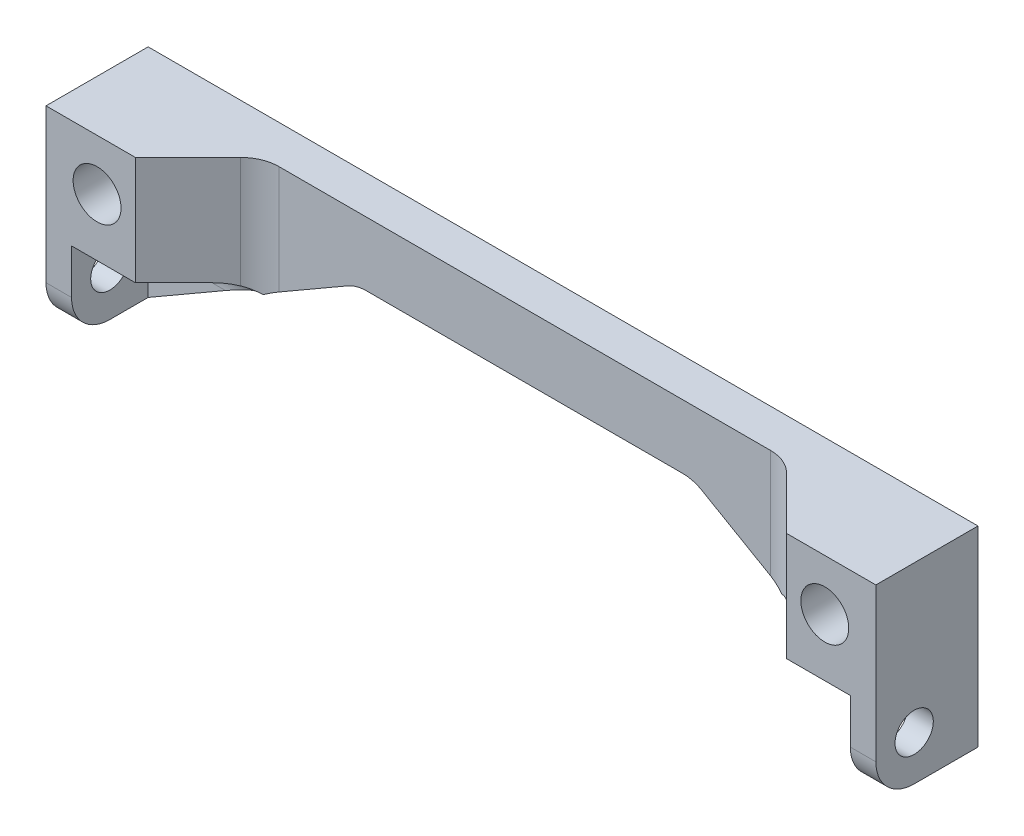
ISO-10303-21;
HEADER;
FILE_DESCRIPTION(('STEP AP214'),'2;1');
FILE_NAME('part.step','',(''),(''),'','','');
FILE_SCHEMA(('AUTOMOTIVE_DESIGN { 1 0 10303 214 1 1 1 1 }'));
ENDSEC;
DATA;
#1=APPLICATION_CONTEXT('core data for automotive mechanical design processes');
#2=APPLICATION_PROTOCOL_DEFINITION('international standard','automotive_design',2000,#1);
#3=PRODUCT_CONTEXT('',#1,'mechanical');
#4=PRODUCT('Part','Part','',(#3));
#5=PRODUCT_RELATED_PRODUCT_CATEGORY('part','',(#4));
#6=PRODUCT_DEFINITION_FORMATION('','',#4);
#7=PRODUCT_DEFINITION_CONTEXT('part definition',#1,'design');
#8=PRODUCT_DEFINITION('design','',#6,#7);
#9=PRODUCT_DEFINITION_SHAPE('','',#8);
#10=(LENGTH_UNIT() NAMED_UNIT(*) SI_UNIT(.MILLI.,.METRE.));
#11=(NAMED_UNIT(*) PLANE_ANGLE_UNIT() SI_UNIT($,.RADIAN.));
#12=(NAMED_UNIT(*) SI_UNIT($,.STERADIAN.) SOLID_ANGLE_UNIT());
#13=UNCERTAINTY_MEASURE_WITH_UNIT(LENGTH_MEASURE(1.E-05),#10,'distance_accuracy_value','');
#14=(GEOMETRIC_REPRESENTATION_CONTEXT(3) GLOBAL_UNCERTAINTY_ASSIGNED_CONTEXT((#13)) GLOBAL_UNIT_ASSIGNED_CONTEXT((#10,
#11,#12)) REPRESENTATION_CONTEXT('',''));
#15=CARTESIAN_POINT('',(0.,0.,0.));
#16=DIRECTION('',(0.,0.,1.));
#17=DIRECTION('',(1.,0.,0.));
#18=AXIS2_PLACEMENT_3D('',#15,#16,#17);
#19=CARTESIAN_POINT('',(-65.,0.,16.));
#20=DIRECTION('',(0.,0.,-1.));
#21=DIRECTION('',(-1.,0.,0.));
#22=AXIS2_PLACEMENT_3D('',#19,#20,#21);
#23=PLANE('',#22);
#24=CARTESIAN_POINT('',(-57.,-8.,16.));
#25=DIRECTION('',(0.,0.,1.));
#26=DIRECTION('',(1.,0.,0.));
#27=AXIS2_PLACEMENT_3D('',#24,#25,#26);
#28=CIRCLE('',#27,3.75);
#29=CARTESIAN_POINT('',(-53.25,-8.,16.));
#30=VERTEX_POINT('',#29);
#31=EDGE_CURVE('E290',#30,#30,#28,.T.);
#32=ORIENTED_EDGE('',*,*,#31,.F.);
#33=EDGE_LOOP('',(#32));
#34=FACE_BOUND('',#33,.T.);
#35=DIRECTION('',(0.,-1.,0.));
#36=VECTOR('',#35,1.);
#37=CARTESIAN_POINT('',(-65.,-30.,16.));
#38=LINE('',#37,#36);
#39=CARTESIAN_POINT('',(-65.,0.,16.));
#40=VERTEX_POINT('',#39);
#41=CARTESIAN_POINT('',(-65.,-24.,16.));
#42=VERTEX_POINT('',#41);
#43=EDGE_CURVE('E296',#40,#42,#38,.T.);
#44=ORIENTED_EDGE('',*,*,#43,.T.);
#45=DIRECTION('',(1.,0.,0.));
#46=VECTOR('',#45,1.);
#47=CARTESIAN_POINT('',(-65.,-24.,16.));
#48=LINE('',#47,#46);
#49=CARTESIAN_POINT('',(-61.,-24.,16.));
#50=VERTEX_POINT('',#49);
#51=EDGE_CURVE('E388',#42,#50,#48,.T.);
#52=ORIENTED_EDGE('',*,*,#51,.T.);
#53=DIRECTION('',(0.,1.,0.));
#54=VECTOR('',#53,1.);
#55=CARTESIAN_POINT('',(-61.,-30.,16.));
#56=LINE('',#55,#54);
#57=CARTESIAN_POINT('',(-61.,-17.,16.));
#58=VERTEX_POINT('',#57);
#59=EDGE_CURVE('E241',#50,#58,#56,.T.);
#60=ORIENTED_EDGE('',*,*,#59,.T.);
#61=DIRECTION('',(-1.,0.,0.));
#62=VECTOR('',#61,1.);
#63=CARTESIAN_POINT('',(-31.,-17.,16.));
#64=LINE('',#63,#62);
#65=CARTESIAN_POINT('',(-51.,-17.,16.));
#66=VERTEX_POINT('',#65);
#67=EDGE_CURVE('E249',#66,#58,#64,.T.);
#68=ORIENTED_EDGE('',*,*,#67,.F.);
#69=DIRECTION('',(0.,1.,0.));
#70=VECTOR('',#69,1.);
#71=CARTESIAN_POINT('',(-51.,-30.,16.));
#72=LINE('',#71,#70);
#73=CARTESIAN_POINT('',(-51.,0.,16.));
#74=VERTEX_POINT('',#73);
#75=EDGE_CURVE('E264',#66,#74,#72,.T.);
#76=ORIENTED_EDGE('',*,*,#75,.T.);
#77=DIRECTION('',(-1.,0.,0.));
#78=VECTOR('',#77,1.);
#79=CARTESIAN_POINT('',(-65.,0.,16.));
#80=LINE('',#79,#78);
#81=EDGE_CURVE('E302',#74,#40,#80,.T.);
#82=ORIENTED_EDGE('',*,*,#81,.T.);
#83=EDGE_LOOP('',(#44,#52,#60,#68,#76,#82));
#84=FACE_BOUND('',#83,.T.);
#85=ADVANCED_FACE('F32',(#34,#84),#23,.F.);
#86=DIRECTION('',(0.,-1.,0.));
#87=VECTOR('',#86,1.);
#88=CARTESIAN_POINT('',(61.,-17.,16.));
#89=LINE('',#88,#87);
#90=CARTESIAN_POINT('',(61.,-17.,16.));
#91=VERTEX_POINT('',#90);
#92=CARTESIAN_POINT('',(61.,-24.,16.));
#93=VERTEX_POINT('',#92);
#94=EDGE_CURVE('E222',#91,#93,#89,.T.);
#95=ORIENTED_EDGE('',*,*,#94,.T.);
#96=DIRECTION('',(1.,0.,0.));
#97=VECTOR('',#96,1.);
#98=CARTESIAN_POINT('',(-65.,-24.,16.));
#99=LINE('',#98,#97);
#100=CARTESIAN_POINT('',(65.,-24.,16.));
#101=VERTEX_POINT('',#100);
#102=EDGE_CURVE('E379',#93,#101,#99,.T.);
#103=ORIENTED_EDGE('',*,*,#102,.T.);
#104=DIRECTION('',(0.,1.,0.));
#105=VECTOR('',#104,1.);
#106=CARTESIAN_POINT('',(65.,0.,16.));
#107=LINE('',#106,#105);
#108=CARTESIAN_POINT('',(65.,0.,16.));
#109=VERTEX_POINT('',#108);
#110=EDGE_CURVE('E299',#101,#109,#107,.T.);
#111=ORIENTED_EDGE('',*,*,#110,.T.);
#112=CARTESIAN_POINT('',(51.,0.,16.));
#113=VERTEX_POINT('',#112);
#114=EDGE_CURVE('E303',#109,#113,#80,.T.);
#115=ORIENTED_EDGE('',*,*,#114,.T.);
#116=DIRECTION('',(0.,1.,0.));
#117=VECTOR('',#116,1.);
#118=CARTESIAN_POINT('',(51.,-30.,16.));
#119=LINE('',#118,#117);
#120=CARTESIAN_POINT('',(51.,-17.,16.));
#121=VERTEX_POINT('',#120);
#122=EDGE_CURVE('E263',#121,#113,#119,.T.);
#123=ORIENTED_EDGE('',*,*,#122,.F.);
#124=DIRECTION('',(1.,0.,0.));
#125=VECTOR('',#124,1.);
#126=CARTESIAN_POINT('',(31.,-17.,16.));
#127=LINE('',#126,#125);
#128=EDGE_CURVE('E210',#121,#91,#127,.T.);
#129=ORIENTED_EDGE('',*,*,#128,.T.);
#130=EDGE_LOOP('',(#95,#103,#111,#115,#123,#129));
#131=FACE_BOUND('',#130,.T.);
#132=CARTESIAN_POINT('',(57.,-8.,16.));
#133=DIRECTION('',(0.,0.,1.));
#134=DIRECTION('',(1.,0.,0.));
#135=AXIS2_PLACEMENT_3D('',#132,#133,#134);
#136=CIRCLE('',#135,3.75000000000001);
#137=CARTESIAN_POINT('',(60.75,-8.,16.));
#138=VERTEX_POINT('',#137);
#139=EDGE_CURVE('E284',#138,#138,#136,.T.);
#140=ORIENTED_EDGE('',*,*,#139,.F.);
#141=EDGE_LOOP('',(#140));
#142=FACE_BOUND('',#141,.T.);
#143=ADVANCED_FACE('F472',(#131,#142),#23,.F.);
#144=CARTESIAN_POINT('',(-65.,0.,0.));
#145=DIRECTION('',(0.,0.,-1.));
#146=DIRECTION('',(-1.,0.,0.));
#147=AXIS2_PLACEMENT_3D('',#144,#145,#146);
#148=PLANE('',#147);
#149=CARTESIAN_POINT('',(-57.,-8.,0.));
#150=DIRECTION('',(0.,0.,1.));
#151=DIRECTION('',(1.,0.,0.));
#152=AXIS2_PLACEMENT_3D('',#149,#150,#151);
#153=CIRCLE('',#152,3.75);
#154=CARTESIAN_POINT('',(-53.25,-8.,0.));
#155=VERTEX_POINT('',#154);
#156=EDGE_CURVE('E287',#155,#155,#153,.T.);
#157=ORIENTED_EDGE('',*,*,#156,.T.);
#158=EDGE_LOOP('',(#157));
#159=FACE_BOUND('',#158,.T.);
#160=DIRECTION('',(0.,-1.,0.));
#161=VECTOR('',#160,1.);
#162=CARTESIAN_POINT('',(-65.,-30.,0.));
#163=LINE('',#162,#161);
#164=CARTESIAN_POINT('',(-65.,0.,0.));
#165=VERTEX_POINT('',#164);
#166=CARTESIAN_POINT('',(-65.,-30.,0.));
#167=VERTEX_POINT('',#166);
#168=EDGE_CURVE('E293',#165,#167,#163,.T.);
#169=ORIENTED_EDGE('',*,*,#168,.F.);
#170=DIRECTION('',(-1.,0.,0.));
#171=VECTOR('',#170,1.);
#172=CARTESIAN_POINT('',(-65.,0.,0.));
#173=LINE('',#172,#171);
#174=CARTESIAN_POINT('',(65.,0.,0.));
#175=VERTEX_POINT('',#174);
#176=EDGE_CURVE('E300',#175,#165,#173,.T.);
#177=ORIENTED_EDGE('',*,*,#176,.F.);
#178=DIRECTION('',(0.,1.,0.));
#179=VECTOR('',#178,1.);
#180=CARTESIAN_POINT('',(65.,0.,0.));
#181=LINE('',#180,#179);
#182=CARTESIAN_POINT('',(65.,-30.,0.));
#183=VERTEX_POINT('',#182);
#184=EDGE_CURVE('E323',#183,#175,#181,.T.);
#185=ORIENTED_EDGE('',*,*,#184,.F.);
#186=DIRECTION('',(1.,0.,0.));
#187=VECTOR('',#186,1.);
#188=CARTESIAN_POINT('',(65.,-30.,0.));
#189=LINE('',#188,#187);
#190=CARTESIAN_POINT('',(61.,-30.,0.));
#191=VERTEX_POINT('',#190);
#192=EDGE_CURVE('E320',#191,#183,#189,.T.);
#193=ORIENTED_EDGE('',*,*,#192,.F.);
#194=DIRECTION('',(0.866025403784438,-0.500000000000001,0.));
#195=VECTOR('',#194,1.);
#196=CARTESIAN_POINT('',(61.,-30.,0.));
#197=LINE('',#196,#195);
#198=CARTESIAN_POINT('',(27.7512886940358,-10.8038475772934,0.));
#199=VERTEX_POINT('',#198);
#200=EDGE_CURVE('E318',#199,#191,#197,.T.);
#201=ORIENTED_EDGE('',*,*,#200,.F.);
#202=CARTESIAN_POINT('',(24.7512886940358,-16.,0.));
#203=DIRECTION('',(0.,0.,-1.));
#204=DIRECTION('',(-1.,0.,0.));
#205=AXIS2_PLACEMENT_3D('',#202,#203,#204);
#206=CIRCLE('',#205,6.);
#207=CARTESIAN_POINT('',(24.7512886940358,-10.,0.));
#208=VERTEX_POINT('',#207);
#209=EDGE_CURVE('E40',#199,#208,#206,.F.);
#210=ORIENTED_EDGE('',*,*,#209,.T.);
#211=DIRECTION('',(1.,0.,0.));
#212=VECTOR('',#211,1.);
#213=CARTESIAN_POINT('',(26.3589838486225,-10.,0.));
#214=LINE('',#213,#212);
#215=CARTESIAN_POINT('',(-24.7512886940359,-10.,0.));
#216=VERTEX_POINT('',#215);
#217=EDGE_CURVE('E315',#216,#208,#214,.T.);
#218=ORIENTED_EDGE('',*,*,#217,.F.);
#219=CARTESIAN_POINT('',(-24.7512886940359,-16.,0.));
#220=DIRECTION('',(0.,0.,-1.));
#221=DIRECTION('',(-1.,0.,0.));
#222=AXIS2_PLACEMENT_3D('',#219,#220,#221);
#223=CIRCLE('',#222,6.);
#224=CARTESIAN_POINT('',(-27.7512886940359,-10.8038475772934,0.));
#225=VERTEX_POINT('',#224);
#226=EDGE_CURVE('E434',#216,#225,#223,.F.);
#227=ORIENTED_EDGE('',*,*,#226,.T.);
#228=DIRECTION('',(0.866025403784438,0.500000000000001,0.));
#229=VECTOR('',#228,1.);
#230=CARTESIAN_POINT('',(-26.3589838486226,-10.,0.));
#231=LINE('',#230,#229);
#232=CARTESIAN_POINT('',(-61.,-30.,0.));
#233=VERTEX_POINT('',#232);
#234=EDGE_CURVE('E312',#233,#225,#231,.T.);
#235=ORIENTED_EDGE('',*,*,#234,.F.);
#236=DIRECTION('',(1.,0.,0.));
#237=VECTOR('',#236,1.);
#238=CARTESIAN_POINT('',(-61.,-30.,0.));
#239=LINE('',#238,#237);
#240=EDGE_CURVE('E309',#167,#233,#239,.T.);
#241=ORIENTED_EDGE('',*,*,#240,.F.);
#242=EDGE_LOOP('',(#169,#177,#185,#193,#201,#210,#218,#227,#235,#241));
#243=FACE_BOUND('',#242,.T.);
#244=CARTESIAN_POINT('',(57.,-8.,0.));
#245=DIRECTION('',(0.,0.,1.));
#246=DIRECTION('',(1.,0.,0.));
#247=AXIS2_PLACEMENT_3D('',#244,#245,#246);
#248=CIRCLE('',#247,3.75000000000001);
#249=CARTESIAN_POINT('',(60.75,-8.,0.));
#250=VERTEX_POINT('',#249);
#251=EDGE_CURVE('E281',#250,#250,#248,.T.);
#252=ORIENTED_EDGE('',*,*,#251,.T.);
#253=EDGE_LOOP('',(#252));
#254=FACE_BOUND('',#253,.T.);
#255=ADVANCED_FACE('F475',(#159,#243,#254),#148,.T.);
#256=CARTESIAN_POINT('',(-65.,-30.,16.));
#257=DIRECTION('',(1.,0.,0.));
#258=DIRECTION('',(0.,0.,-1.));
#259=AXIS2_PLACEMENT_3D('',#256,#257,#258);
#260=PLANE('',#259);
#261=CARTESIAN_POINT('',(-65.,-23.,10.));
#262=DIRECTION('',(1.,0.,0.));
#263=DIRECTION('',(0.,0.,-1.));
#264=AXIS2_PLACEMENT_3D('',#261,#262,#263);
#265=CIRCLE('',#264,3.);
#266=CARTESIAN_POINT('',(-65.,-23.,7.));
#267=VERTEX_POINT('',#266);
#268=EDGE_CURVE('E278',#267,#267,#265,.T.);
#269=ORIENTED_EDGE('',*,*,#268,.T.);
#270=EDGE_LOOP('',(#269));
#271=FACE_BOUND('',#270,.T.);
#272=DIRECTION('',(0.,0.,-1.));
#273=VECTOR('',#272,1.);
#274=CARTESIAN_POINT('',(-65.,-30.,16.));
#275=LINE('',#274,#273);
#276=CARTESIAN_POINT('',(-65.,-30.,10.));
#277=VERTEX_POINT('',#276);
#278=EDGE_CURVE('E339',#277,#167,#275,.T.);
#279=ORIENTED_EDGE('',*,*,#278,.F.);
#280=CARTESIAN_POINT('',(-65.,-24.,10.));
#281=DIRECTION('',(1.,0.,0.));
#282=DIRECTION('',(0.,0.,-1.));
#283=AXIS2_PLACEMENT_3D('',#280,#281,#282);
#284=CIRCLE('',#283,6.);
#285=EDGE_CURVE('E395',#277,#42,#284,.F.);
#286=ORIENTED_EDGE('',*,*,#285,.T.);
#287=ORIENTED_EDGE('',*,*,#43,.F.);
#288=DIRECTION('',(0.,0.,-1.));
#289=VECTOR('',#288,1.);
#290=CARTESIAN_POINT('',(-65.,0.,16.));
#291=LINE('',#290,#289);
#292=EDGE_CURVE('E306',#40,#165,#291,.T.);
#293=ORIENTED_EDGE('',*,*,#292,.T.);
#294=ORIENTED_EDGE('',*,*,#168,.T.);
#295=EDGE_LOOP('',(#279,#286,#287,#293,#294));
#296=FACE_BOUND('',#295,.T.);
#297=ADVANCED_FACE('F418',(#271,#296),#260,.F.);
#298=CARTESIAN_POINT('',(-61.,-30.,16.));
#299=DIRECTION('',(0.,1.,0.));
#300=DIRECTION('',(0.,0.,1.));
#301=AXIS2_PLACEMENT_3D('',#298,#299,#300);
#302=PLANE('',#301);
#303=DIRECTION('',(0.,0.,-1.));
#304=VECTOR('',#303,1.);
#305=CARTESIAN_POINT('',(-61.,-30.,16.));
#306=LINE('',#305,#304);
#307=CARTESIAN_POINT('',(-61.,-30.,10.));
#308=VERTEX_POINT('',#307);
#309=CARTESIAN_POINT('',(-61.,-30.,4.));
#310=VERTEX_POINT('',#309);
#311=EDGE_CURVE('E337',#308,#310,#306,.T.);
#312=ORIENTED_EDGE('',*,*,#311,.F.);
#313=DIRECTION('',(1.,0.,0.));
#314=VECTOR('',#313,1.);
#315=CARTESIAN_POINT('',(-61.,-30.,10.));
#316=LINE('',#315,#314);
#317=EDGE_CURVE('E393',#308,#277,#316,.F.);
#318=ORIENTED_EDGE('',*,*,#317,.T.);
#319=ORIENTED_EDGE('',*,*,#278,.T.);
#320=ORIENTED_EDGE('',*,*,#240,.T.);
#321=EDGE_CURVE('E336',#310,#233,#306,.T.);
#322=ORIENTED_EDGE('',*,*,#321,.F.);
#323=EDGE_LOOP('',(#312,#318,#319,#320,#322));
#324=FACE_BOUND('',#323,.T.);
#325=ADVANCED_FACE('F500',(#324),#302,.F.);
#326=CARTESIAN_POINT('',(-26.3589838486226,-10.,16.));
#327=DIRECTION('',(-0.500000000000001,0.866025403784438,0.));
#328=DIRECTION('',(-0.866025403784438,-0.500000000000001,0.));
#329=AXIS2_PLACEMENT_3D('',#326,#327,#328);
#330=PLANE('',#329);
#331=ORIENTED_EDGE('',*,*,#234,.T.);
#332=DIRECTION('',(0.,0.,-1.));
#333=VECTOR('',#332,1.);
#334=CARTESIAN_POINT('',(-27.7512886940359,-10.8038475772934,6.));
#335=LINE('',#334,#333);
#336=CARTESIAN_POINT('',(-27.7512886940359,-10.8038475772934,6.));
#337=VERTEX_POINT('',#336);
#338=EDGE_CURVE('E374',#225,#337,#335,.F.);
#339=ORIENTED_EDGE('',*,*,#338,.T.);
#340=DIRECTION('',(-0.866025403784438,-0.500000000000001,0.));
#341=VECTOR('',#340,1.);
#342=CARTESIAN_POINT('',(-26.3589838486226,-10.,6.));
#343=LINE('',#342,#341);
#344=CARTESIAN_POINT('',(-38.5147186257613,-17.0181167457788,6.));
#345=VERTEX_POINT('',#344);
#346=EDGE_CURVE('E274',#337,#345,#343,.T.);
#347=ORIENTED_EDGE('',*,*,#346,.T.);
#348=CARTESIAN_POINT('',(-38.5147186257613,-17.0181167457788,12.));
#349=DIRECTION('',(-0.500000000000001,0.866025403784438,0.));
#350=DIRECTION('',(-0.866025403784438,-0.500000000000001,0.));
#351=AXIS2_PLACEMENT_3D('',#348,#349,#350);
#352=ELLIPSE('',#351,6.92820323027551,6.);
#353=CARTESIAN_POINT('',(-40.597131047197,-18.2203981178585,6.37296183529465));
#354=VERTEX_POINT('',#353);
#355=EDGE_CURVE('E435',#345,#354,#352,.T.);
#356=ORIENTED_EDGE('',*,*,#355,.T.);
#357=CARTESIAN_POINT('',(-48.8756443470179,-23.,10.));
#358=DIRECTION('',(-0.500000000000001,0.866025403784438,0.));
#359=DIRECTION('',(-0.866025403784438,-0.500000000000001,0.));
#360=AXIS2_PLACEMENT_3D('',#357,#358,#359);
#361=ELLIPSE('',#360,12.,6.);
#362=CARTESIAN_POINT('',(-48.8756443470179,-23.,4.));
#363=VERTEX_POINT('',#362);
#364=EDGE_CURVE('E47',#354,#363,#361,.T.);
#365=ORIENTED_EDGE('',*,*,#364,.T.);
#366=DIRECTION('',(-0.866025403784438,-0.500000000000001,0.));
#367=VECTOR('',#366,1.);
#368=CARTESIAN_POINT('',(-26.3589838486226,-10.,4.));
#369=LINE('',#368,#367);
#370=EDGE_CURVE('E347',#363,#310,#369,.T.);
#371=ORIENTED_EDGE('',*,*,#370,.T.);
#372=ORIENTED_EDGE('',*,*,#321,.T.);
#373=EDGE_LOOP('',(#331,#339,#347,#356,#365,#371,#372));
#374=FACE_BOUND('',#373,.T.);
#375=ADVANCED_FACE('F497',(#374),#330,.F.);
#376=CARTESIAN_POINT('',(26.3589838486225,-10.,16.));
#377=DIRECTION('',(0.,1.,0.));
#378=DIRECTION('',(-1.,0.,0.));
#379=AXIS2_PLACEMENT_3D('',#376,#377,#378);
#380=PLANE('',#379);
#381=DIRECTION('',(-1.,0.,0.));
#382=VECTOR('',#381,1.);
#383=CARTESIAN_POINT('',(26.3589838486225,-10.,6.));
#384=LINE('',#383,#382);
#385=CARTESIAN_POINT('',(24.7512886940358,-10.,6.));
#386=VERTEX_POINT('',#385);
#387=CARTESIAN_POINT('',(-24.7512886940359,-10.,6.));
#388=VERTEX_POINT('',#387);
#389=EDGE_CURVE('E271',#386,#388,#384,.T.);
#390=ORIENTED_EDGE('',*,*,#389,.T.);
#391=DIRECTION('',(0.,0.,-1.));
#392=VECTOR('',#391,1.);
#393=CARTESIAN_POINT('',(-24.7512886940359,-10.,0.));
#394=LINE('',#393,#392);
#395=EDGE_CURVE('E371',#388,#216,#394,.T.);
#396=ORIENTED_EDGE('',*,*,#395,.T.);
#397=ORIENTED_EDGE('',*,*,#217,.T.);
#398=DIRECTION('',(0.,0.,-1.));
#399=VECTOR('',#398,1.);
#400=CARTESIAN_POINT('',(24.7512886940358,-10.,6.));
#401=LINE('',#400,#399);
#402=EDGE_CURVE('E369',#208,#386,#401,.F.);
#403=ORIENTED_EDGE('',*,*,#402,.T.);
#404=EDGE_LOOP('',(#390,#396,#397,#403));
#405=FACE_BOUND('',#404,.T.);
#406=ADVANCED_FACE('F494',(#405),#380,.F.);
#407=CARTESIAN_POINT('',(61.,-30.,16.));
#408=DIRECTION('',(0.500000000000001,0.866025403784438,0.));
#409=DIRECTION('',(-0.866025403784438,0.500000000000001,0.));
#410=AXIS2_PLACEMENT_3D('',#407,#408,#409);
#411=PLANE('',#410);
#412=DIRECTION('',(-0.866025403784438,0.500000000000001,0.));
#413=VECTOR('',#412,1.);
#414=CARTESIAN_POINT('',(61.,-30.,6.));
#415=LINE('',#414,#413);
#416=CARTESIAN_POINT('',(38.5147186257615,-17.0181167457789,6.));
#417=VERTEX_POINT('',#416);
#418=CARTESIAN_POINT('',(27.7512886940358,-10.8038475772934,6.));
#419=VERTEX_POINT('',#418);
#420=EDGE_CURVE('E267',#417,#419,#415,.T.);
#421=ORIENTED_EDGE('',*,*,#420,.T.);
#422=DIRECTION('',(0.,0.,-1.));
#423=VECTOR('',#422,1.);
#424=CARTESIAN_POINT('',(27.7512886940358,-10.8038475772934,0.));
#425=LINE('',#424,#423);
#426=EDGE_CURVE('E376',#419,#199,#425,.T.);
#427=ORIENTED_EDGE('',*,*,#426,.T.);
#428=ORIENTED_EDGE('',*,*,#200,.T.);
#429=DIRECTION('',(0.,0.,-1.));
#430=VECTOR('',#429,1.);
#431=CARTESIAN_POINT('',(61.,-30.,16.));
#432=LINE('',#431,#430);
#433=CARTESIAN_POINT('',(61.,-30.,4.));
#434=VERTEX_POINT('',#433);
#435=EDGE_CURVE('E333',#434,#191,#432,.T.);
#436=ORIENTED_EDGE('',*,*,#435,.F.);
#437=DIRECTION('',(-0.866025403784438,0.500000000000001,0.));
#438=VECTOR('',#437,1.);
#439=CARTESIAN_POINT('',(61.,-30.,4.));
#440=LINE('',#439,#438);
#441=CARTESIAN_POINT('',(48.8756443470179,-23.,4.));
#442=VERTEX_POINT('',#441);
#443=EDGE_CURVE('E355',#434,#442,#440,.T.);
#444=ORIENTED_EDGE('',*,*,#443,.T.);
#445=CARTESIAN_POINT('',(48.8756443470179,-23.,10.));
#446=DIRECTION('',(0.500000000000001,0.866025403784438,0.));
#447=DIRECTION('',(0.866025403784438,-0.500000000000001,0.));
#448=AXIS2_PLACEMENT_3D('',#445,#446,#447);
#449=ELLIPSE('',#448,12.,6.);
#450=CARTESIAN_POINT('',(40.597131047197,-18.2203981178585,6.3729618352946));
#451=VERTEX_POINT('',#450);
#452=EDGE_CURVE('E55',#442,#451,#449,.T.);
#453=ORIENTED_EDGE('',*,*,#452,.T.);
#454=CARTESIAN_POINT('',(38.5147186257615,-17.0181167457789,12.));
#455=DIRECTION('',(0.500000000000001,0.866025403784438,0.));
#456=DIRECTION('',(0.866025403784438,-0.500000000000001,0.));
#457=AXIS2_PLACEMENT_3D('',#454,#455,#456);
#458=ELLIPSE('',#457,6.92820323027551,6.);
#459=EDGE_CURVE('E406',#451,#417,#458,.T.);
#460=ORIENTED_EDGE('',*,*,#459,.T.);
#461=EDGE_LOOP('',(#421,#427,#428,#436,#444,#453,#460));
#462=FACE_BOUND('',#461,.T.);
#463=ADVANCED_FACE('F490',(#462),#411,.F.);
#464=CARTESIAN_POINT('',(65.,-30.,16.));
#465=DIRECTION('',(0.,1.,0.));
#466=DIRECTION('',(0.,0.,1.));
#467=AXIS2_PLACEMENT_3D('',#464,#465,#466);
#468=PLANE('',#467);
#469=DIRECTION('',(0.,0.,-1.));
#470=VECTOR('',#469,1.);
#471=CARTESIAN_POINT('',(65.,-30.,16.));
#472=LINE('',#471,#470);
#473=CARTESIAN_POINT('',(65.,-30.,10.));
#474=VERTEX_POINT('',#473);
#475=EDGE_CURVE('E331',#474,#183,#472,.T.);
#476=ORIENTED_EDGE('',*,*,#475,.F.);
#477=DIRECTION('',(1.,0.,0.));
#478=VECTOR('',#477,1.);
#479=CARTESIAN_POINT('',(65.,-30.,10.));
#480=LINE('',#479,#478);
#481=CARTESIAN_POINT('',(61.,-30.,10.));
#482=VERTEX_POINT('',#481);
#483=EDGE_CURVE('E384',#474,#482,#480,.F.);
#484=ORIENTED_EDGE('',*,*,#483,.T.);
#485=EDGE_CURVE('E334',#482,#434,#432,.T.);
#486=ORIENTED_EDGE('',*,*,#485,.T.);
#487=ORIENTED_EDGE('',*,*,#435,.T.);
#488=ORIENTED_EDGE('',*,*,#192,.T.);
#489=EDGE_LOOP('',(#476,#484,#486,#487,#488));
#490=FACE_BOUND('',#489,.T.);
#491=ADVANCED_FACE('F486',(#490),#468,.F.);
#492=CARTESIAN_POINT('',(65.,0.,16.));
#493=DIRECTION('',(-1.,0.,0.));
#494=DIRECTION('',(0.,0.,1.));
#495=AXIS2_PLACEMENT_3D('',#492,#493,#494);
#496=PLANE('',#495);
#497=CARTESIAN_POINT('',(65.,-23.,10.));
#498=DIRECTION('',(1.,0.,0.));
#499=DIRECTION('',(0.,0.,-1.));
#500=AXIS2_PLACEMENT_3D('',#497,#498,#499);
#501=CIRCLE('',#500,3.);
#502=CARTESIAN_POINT('',(65.,-23.,7.));
#503=VERTEX_POINT('',#502);
#504=EDGE_CURVE('E277',#503,#503,#501,.T.);
#505=ORIENTED_EDGE('',*,*,#504,.F.);
#506=EDGE_LOOP('',(#505));
#507=FACE_BOUND('',#506,.T.);
#508=ORIENTED_EDGE('',*,*,#110,.F.);
#509=CARTESIAN_POINT('',(65.,-24.,10.));
#510=DIRECTION('',(-1.,0.,0.));
#511=DIRECTION('',(0.,0.,1.));
#512=AXIS2_PLACEMENT_3D('',#509,#510,#511);
#513=CIRCLE('',#512,6.);
#514=EDGE_CURVE('E382',#101,#474,#513,.F.);
#515=ORIENTED_EDGE('',*,*,#514,.T.);
#516=ORIENTED_EDGE('',*,*,#475,.T.);
#517=ORIENTED_EDGE('',*,*,#184,.T.);
#518=DIRECTION('',(0.,0.,-1.));
#519=VECTOR('',#518,1.);
#520=CARTESIAN_POINT('',(65.,0.,16.));
#521=LINE('',#520,#519);
#522=EDGE_CURVE('E328',#109,#175,#521,.T.);
#523=ORIENTED_EDGE('',*,*,#522,.F.);
#524=EDGE_LOOP('',(#508,#515,#516,#517,#523));
#525=FACE_BOUND('',#524,.T.);
#526=ADVANCED_FACE('F482',(#507,#525),#496,.F.);
#527=CARTESIAN_POINT('',(-65.,0.,16.));
#528=DIRECTION('',(0.,-1.,0.));
#529=DIRECTION('',(0.,0.,-1.));
#530=AXIS2_PLACEMENT_3D('',#527,#528,#529);
#531=PLANE('',#530);
#532=ORIENTED_EDGE('',*,*,#81,.F.);
#533=DIRECTION('',(-0.707106781186551,0.,0.707106781186544));
#534=VECTOR('',#533,1.);
#535=CARTESIAN_POINT('',(-51.,0.,16.));
#536=LINE('',#535,#534);
#537=CARTESIAN_POINT('',(-42.7573593128806,0.,7.75735931288069));
#538=VERTEX_POINT('',#537);
#539=EDGE_CURVE('E261',#538,#74,#536,.T.);
#540=ORIENTED_EDGE('',*,*,#539,.F.);
#541=CARTESIAN_POINT('',(-38.5147186257613,0.,12.));
#542=DIRECTION('',(0.,-1.,0.));
#543=DIRECTION('',(0.,0.,-1.));
#544=AXIS2_PLACEMENT_3D('',#541,#542,#543);
#545=CIRCLE('',#544,6.);
#546=CARTESIAN_POINT('',(-38.5147186257613,0.,6.));
#547=VERTEX_POINT('',#546);
#548=EDGE_CURVE('E542',#538,#547,#545,.T.);
#549=ORIENTED_EDGE('',*,*,#548,.T.);
#550=DIRECTION('',(-1.,0.,0.));
#551=VECTOR('',#550,1.);
#552=CARTESIAN_POINT('',(-40.9999999999999,0.,6.));
#553=LINE('',#552,#551);
#554=CARTESIAN_POINT('',(38.5147186257615,0.,6.));
#555=VERTEX_POINT('',#554);
#556=EDGE_CURVE('E258',#555,#547,#553,.T.);
#557=ORIENTED_EDGE('',*,*,#556,.F.);
#558=CARTESIAN_POINT('',(38.5147186257615,0.,12.));
#559=DIRECTION('',(0.,-1.,0.));
#560=DIRECTION('',(0.,0.,-1.));
#561=AXIS2_PLACEMENT_3D('',#558,#559,#560);
#562=CIRCLE('',#561,6.);
#563=CARTESIAN_POINT('',(42.7573593128808,0.,7.75735931288074));
#564=VERTEX_POINT('',#563);
#565=EDGE_CURVE('E397',#555,#564,#562,.T.);
#566=ORIENTED_EDGE('',*,*,#565,.T.);
#567=DIRECTION('',(-0.707106781186544,0.,-0.707106781186551));
#568=VECTOR('',#567,1.);
#569=CARTESIAN_POINT('',(41.0000000000001,0.,6.));
#570=LINE('',#569,#568);
#571=EDGE_CURVE('E255',#113,#564,#570,.T.);
#572=ORIENTED_EDGE('',*,*,#571,.F.);
#573=ORIENTED_EDGE('',*,*,#114,.F.);
#574=ORIENTED_EDGE('',*,*,#522,.T.);
#575=ORIENTED_EDGE('',*,*,#176,.T.);
#576=ORIENTED_EDGE('',*,*,#292,.F.);
#577=EDGE_LOOP('',(#532,#540,#549,#557,#566,#572,#573,#574,#575,#576));
#578=FACE_BOUND('',#577,.T.);
#579=ADVANCED_FACE('F470',(#578),#531,.F.);
#580=CARTESIAN_POINT('',(-57.,-8.,16.));
#581=DIRECTION('',(0.,0.,-1.));
#582=DIRECTION('',(-1.,0.,0.));
#583=AXIS2_PLACEMENT_3D('',#580,#581,#582);
#584=CYLINDRICAL_SURFACE('',#583,3.75);
#585=ORIENTED_EDGE('',*,*,#31,.T.);
#586=EDGE_LOOP('',(#585));
#587=FACE_BOUND('',#586,.T.);
#588=ORIENTED_EDGE('',*,*,#156,.F.);
#589=EDGE_LOOP('',(#588));
#590=FACE_BOUND('',#589,.T.);
#591=ADVANCED_FACE('F466',(#587,#590),#584,.F.);
#592=CARTESIAN_POINT('',(57.,-8.,16.));
#593=DIRECTION('',(0.,0.,-1.));
#594=DIRECTION('',(-1.,0.,0.));
#595=AXIS2_PLACEMENT_3D('',#592,#593,#594);
#596=CYLINDRICAL_SURFACE('',#595,3.75000000000001);
#597=ORIENTED_EDGE('',*,*,#139,.T.);
#598=EDGE_LOOP('',(#597));
#599=FACE_BOUND('',#598,.T.);
#600=ORIENTED_EDGE('',*,*,#251,.F.);
#601=EDGE_LOOP('',(#600));
#602=FACE_BOUND('',#601,.T.);
#603=ADVANCED_FACE('F463',(#599,#602),#596,.F.);
#604=CARTESIAN_POINT('',(-65.,-23.,10.));
#605=DIRECTION('',(1.,0.,0.));
#606=DIRECTION('',(0.,0.,-1.));
#607=AXIS2_PLACEMENT_3D('',#604,#605,#606);
#608=CYLINDRICAL_SURFACE('',#607,3.);
#609=CARTESIAN_POINT('',(61.,-23.,10.));
#610=DIRECTION('',(1.,0.,0.));
#611=DIRECTION('',(0.,0.,-1.));
#612=AXIS2_PLACEMENT_3D('',#609,#610,#611);
#613=CIRCLE('',#612,3.);
#614=CARTESIAN_POINT('',(61.,-23.,7.));
#615=VERTEX_POINT('',#614);
#616=EDGE_CURVE('E234',#615,#615,#613,.F.);
#617=ORIENTED_EDGE('',*,*,#616,.T.);
#618=EDGE_LOOP('',(#617));
#619=FACE_BOUND('',#618,.T.);
#620=ORIENTED_EDGE('',*,*,#504,.T.);
#621=EDGE_LOOP('',(#620));
#622=FACE_BOUND('',#621,.T.);
#623=ADVANCED_FACE('F461',(#619,#622),#608,.F.);
#624=CARTESIAN_POINT('',(-61.,-23.,10.));
#625=DIRECTION('',(-1.,0.,0.));
#626=DIRECTION('',(0.,0.,1.));
#627=AXIS2_PLACEMENT_3D('',#624,#625,#626);
#628=CIRCLE('',#627,3.);
#629=CARTESIAN_POINT('',(-61.,-23.,13.));
#630=VERTEX_POINT('',#629);
#631=EDGE_CURVE('E254',#630,#630,#628,.F.);
#632=ORIENTED_EDGE('',*,*,#631,.T.);
#633=EDGE_LOOP('',(#632));
#634=FACE_BOUND('',#633,.T.);
#635=ORIENTED_EDGE('',*,*,#268,.F.);
#636=EDGE_LOOP('',(#635));
#637=FACE_BOUND('',#636,.T.);
#638=ADVANCED_FACE('F454',(#634,#637),#608,.F.);
#639=CARTESIAN_POINT('',(-40.9999999999999,-30.,6.));
#640=DIRECTION('',(0.,0.,-1.));
#641=DIRECTION('',(-1.,0.,0.));
#642=AXIS2_PLACEMENT_3D('',#639,#640,#641);
#643=PLANE('',#642);
#644=ORIENTED_EDGE('',*,*,#420,.F.);
#645=DIRECTION('',(0.,1.,0.));
#646=VECTOR('',#645,1.);
#647=CARTESIAN_POINT('',(38.5147186257615,0.,6.));
#648=LINE('',#647,#646);
#649=EDGE_CURVE('E361',#417,#555,#648,.T.);
#650=ORIENTED_EDGE('',*,*,#649,.T.);
#651=ORIENTED_EDGE('',*,*,#556,.T.);
#652=DIRECTION('',(0.,1.,0.));
#653=VECTOR('',#652,1.);
#654=CARTESIAN_POINT('',(-38.5147186257613,-18.4529946162074,6.));
#655=LINE('',#654,#653);
#656=EDGE_CURVE('E359',#547,#345,#655,.F.);
#657=ORIENTED_EDGE('',*,*,#656,.T.);
#658=ORIENTED_EDGE('',*,*,#346,.F.);
#659=CARTESIAN_POINT('',(-24.7512886940359,-16.,6.));
#660=DIRECTION('',(0.,0.,-1.));
#661=DIRECTION('',(-1.,0.,0.));
#662=AXIS2_PLACEMENT_3D('',#659,#660,#661);
#663=CIRCLE('',#662,6.);
#664=EDGE_CURVE('E551',#337,#388,#663,.T.);
#665=ORIENTED_EDGE('',*,*,#664,.T.);
#666=ORIENTED_EDGE('',*,*,#389,.F.);
#667=CARTESIAN_POINT('',(24.7512886940358,-16.,6.));
#668=DIRECTION('',(0.,0.,-1.));
#669=DIRECTION('',(-1.,0.,0.));
#670=AXIS2_PLACEMENT_3D('',#667,#668,#669);
#671=CIRCLE('',#670,6.);
#672=EDGE_CURVE('E11',#386,#419,#671,.T.);
#673=ORIENTED_EDGE('',*,*,#672,.T.);
#674=EDGE_LOOP('',(#644,#650,#651,#657,#658,#665,#666,#673));
#675=FACE_BOUND('',#674,.T.);
#676=ADVANCED_FACE('F451',(#675),#643,.F.);
#677=CARTESIAN_POINT('',(41.0000000000001,-30.,6.));
#678=DIRECTION('',(0.707106781186551,0.,-0.707106781186544));
#679=DIRECTION('',(-0.707106781186544,0.,-0.707106781186551));
#680=AXIS2_PLACEMENT_3D('',#677,#678,#679);
#681=PLANE('',#680);
#682=ORIENTED_EDGE('',*,*,#571,.T.);
#683=DIRECTION('',(0.,1.,0.));
#684=VECTOR('',#683,1.);
#685=CARTESIAN_POINT('',(42.7573593128808,-18.4529946162075,7.75735931288074));
#686=LINE('',#685,#684);
#687=CARTESIAN_POINT('',(42.7573593128808,-17.4348798082631,7.75735931288074));
#688=VERTEX_POINT('',#687);
#689=EDGE_CURVE('E364',#564,#688,#686,.F.);
#690=ORIENTED_EDGE('',*,*,#689,.T.);
#691=CARTESIAN_POINT('',(45.0000000000001,-23.,10.));
#692=DIRECTION('',(0.707106781186551,0.,-0.707106781186544));
#693=DIRECTION('',(0.707106781186544,0.,0.707106781186551));
#694=AXIS2_PLACEMENT_3D('',#691,#692,#693);
#695=ELLIPSE('',#694,8.48528137423852,6.);
#696=CARTESIAN_POINT('',(45.0000000000001,-17.,10.));
#697=VERTEX_POINT('',#696);
#698=EDGE_CURVE('E353',#688,#697,#695,.T.);
#699=ORIENTED_EDGE('',*,*,#698,.T.);
#700=DIRECTION('',(0.707106781186544,0.,0.707106781186551));
#701=VECTOR('',#700,1.);
#702=CARTESIAN_POINT('',(41.0000000000001,-17.,6.));
#703=LINE('',#702,#701);
#704=EDGE_CURVE('E206',#697,#121,#703,.T.);
#705=ORIENTED_EDGE('',*,*,#704,.T.);
#706=ORIENTED_EDGE('',*,*,#122,.T.);
#707=EDGE_LOOP('',(#682,#690,#699,#705,#706));
#708=FACE_BOUND('',#707,.T.);
#709=ADVANCED_FACE('F449',(#708),#681,.F.);
#710=CARTESIAN_POINT('',(-51.,-30.,16.));
#711=DIRECTION('',(-0.707106781186544,0.,-0.707106781186551));
#712=DIRECTION('',(-0.707106781186551,0.,0.707106781186544));
#713=AXIS2_PLACEMENT_3D('',#710,#711,#712);
#714=PLANE('',#713);
#715=CARTESIAN_POINT('',(-44.9999999999999,-23.,10.));
#716=DIRECTION('',(-0.707106781186544,0.,-0.707106781186551));
#717=DIRECTION('',(-0.707106781186551,0.,0.707106781186544));
#718=AXIS2_PLACEMENT_3D('',#715,#716,#717);
#719=ELLIPSE('',#718,8.48528137423861,6.);
#720=CARTESIAN_POINT('',(-44.9999999999999,-17.,10.));
#721=VERTEX_POINT('',#720);
#722=CARTESIAN_POINT('',(-42.7573593128806,-17.4348798082632,7.75735931288069));
#723=VERTEX_POINT('',#722);
#724=EDGE_CURVE('E344',#721,#723,#719,.T.);
#725=ORIENTED_EDGE('',*,*,#724,.T.);
#726=DIRECTION('',(0.,1.,0.));
#727=VECTOR('',#726,1.);
#728=CARTESIAN_POINT('',(-42.7573593128806,0.,7.75735931288069));
#729=LINE('',#728,#727);
#730=EDGE_CURVE('E366',#723,#538,#729,.T.);
#731=ORIENTED_EDGE('',*,*,#730,.T.);
#732=ORIENTED_EDGE('',*,*,#539,.T.);
#733=ORIENTED_EDGE('',*,*,#75,.F.);
#734=DIRECTION('',(0.707106781186551,0.,-0.707106781186544));
#735=VECTOR('',#734,1.);
#736=CARTESIAN_POINT('',(-51.,-17.,16.));
#737=LINE('',#736,#735);
#738=EDGE_CURVE('E341',#66,#721,#737,.T.);
#739=ORIENTED_EDGE('',*,*,#738,.T.);
#740=EDGE_LOOP('',(#725,#731,#732,#733,#739));
#741=FACE_BOUND('',#740,.T.);
#742=ADVANCED_FACE('F446',(#741),#714,.F.);
#743=CARTESIAN_POINT('',(-31.,-23.,4.));
#744=DIRECTION('',(0.,0.,-1.));
#745=DIRECTION('',(-1.,0.,0.));
#746=AXIS2_PLACEMENT_3D('',#743,#744,#745);
#747=PLANE('',#746);
#748=DIRECTION('',(-1.,0.,0.));
#749=VECTOR('',#748,1.);
#750=CARTESIAN_POINT('',(-31.,-23.,4.));
#751=LINE('',#750,#749);
#752=CARTESIAN_POINT('',(-61.,-23.,4.));
#753=VERTEX_POINT('',#752);
#754=EDGE_CURVE('E246',#363,#753,#751,.T.);
#755=ORIENTED_EDGE('',*,*,#754,.T.);
#756=DIRECTION('',(0.,-1.,0.));
#757=VECTOR('',#756,1.);
#758=CARTESIAN_POINT('',(-61.,-23.,4.));
#759=LINE('',#758,#757);
#760=EDGE_CURVE('E238',#753,#310,#759,.T.);
#761=ORIENTED_EDGE('',*,*,#760,.T.);
#762=ORIENTED_EDGE('',*,*,#370,.F.);
#763=EDGE_LOOP('',(#755,#761,#762));
#764=FACE_BOUND('',#763,.T.);
#765=ADVANCED_FACE('F444',(#764),#747,.F.);
#766=CARTESIAN_POINT('',(-61.,-23.,10.));
#767=DIRECTION('',(-1.,0.,0.));
#768=DIRECTION('',(0.,0.,1.));
#769=AXIS2_PLACEMENT_3D('',#766,#767,#768);
#770=PLANE('',#769);
#771=ORIENTED_EDGE('',*,*,#59,.F.);
#772=CARTESIAN_POINT('',(-61.,-24.,10.));
#773=DIRECTION('',(-1.,0.,0.));
#774=DIRECTION('',(0.,0.,1.));
#775=AXIS2_PLACEMENT_3D('',#772,#773,#774);
#776=CIRCLE('',#775,6.);
#777=EDGE_CURVE('E391',#50,#308,#776,.F.);
#778=ORIENTED_EDGE('',*,*,#777,.T.);
#779=ORIENTED_EDGE('',*,*,#311,.T.);
#780=ORIENTED_EDGE('',*,*,#760,.F.);
#781=CARTESIAN_POINT('',(-61.,-23.,10.));
#782=DIRECTION('',(-1.,0.,0.));
#783=DIRECTION('',(0.,0.,1.));
#784=AXIS2_PLACEMENT_3D('',#781,#782,#783);
#785=CIRCLE('',#784,6.);
#786=CARTESIAN_POINT('',(-61.,-17.,10.));
#787=VERTEX_POINT('',#786);
#788=EDGE_CURVE('E235',#787,#753,#785,.T.);
#789=ORIENTED_EDGE('',*,*,#788,.F.);
#790=DIRECTION('',(0.,0.,-1.));
#791=VECTOR('',#790,1.);
#792=CARTESIAN_POINT('',(-61.,-17.,16.));
#793=LINE('',#792,#791);
#794=EDGE_CURVE('E243',#58,#787,#793,.T.);
#795=ORIENTED_EDGE('',*,*,#794,.F.);
#796=EDGE_LOOP('',(#771,#778,#779,#780,#789,#795));
#797=FACE_BOUND('',#796,.T.);
#798=ORIENTED_EDGE('',*,*,#631,.F.);
#799=EDGE_LOOP('',(#798));
#800=FACE_BOUND('',#799,.T.);
#801=ADVANCED_FACE('F443',(#797,#800),#770,.F.);
#802=CARTESIAN_POINT('',(-31.,-23.,10.));
#803=DIRECTION('',(-1.,0.,0.));
#804=DIRECTION('',(0.,0.,1.));
#805=AXIS2_PLACEMENT_3D('',#802,#803,#804);
#806=CYLINDRICAL_SURFACE('',#805,6.);
#807=ORIENTED_EDGE('',*,*,#724,.F.);
#808=DIRECTION('',(-1.,0.,0.));
#809=VECTOR('',#808,1.);
#810=CARTESIAN_POINT('',(-31.,-17.,10.));
#811=LINE('',#810,#809);
#812=EDGE_CURVE('E247',#721,#787,#811,.T.);
#813=ORIENTED_EDGE('',*,*,#812,.T.);
#814=ORIENTED_EDGE('',*,*,#788,.T.);
#815=ORIENTED_EDGE('',*,*,#754,.F.);
#816=ORIENTED_EDGE('',*,*,#364,.F.);
#817=CARTESIAN_POINT('',(-40.597131047197,-18.2203981178585,6.37296183529465));
#818=CARTESIAN_POINT('',(-40.7632736294496,-18.1737082870404,6.43447164442366));
#819=CARTESIAN_POINT('',(-40.9257805719724,-18.1236201848978,6.5029526358869));
#820=CARTESIAN_POINT('',(-41.2431171695995,-18.0192150638918,6.65334200497535));
#821=CARTESIAN_POINT('',(-41.3979445569978,-17.9648968079274,6.73525431836829));
#822=CARTESIAN_POINT('',(-41.6968632811904,-17.8555638537187,6.91045725573054));
#823=CARTESIAN_POINT('',(-41.8410921005387,-17.8005765607586,7.00353151263349));
#824=CARTESIAN_POINT('',(-42.1211506565617,-17.6912639151262,7.20176543704689));
#825=CARTESIAN_POINT('',(-42.2569855970776,-17.6369381694446,7.30691749885242));
#826=CARTESIAN_POINT('',(-42.4518619643241,-17.5583951180973,7.4716646477789));
#827=CARTESIAN_POINT('',(-42.5143355690473,-17.5331172259344,7.5267435428097));
#828=CARTESIAN_POINT('',(-42.6373734882265,-17.4833321691664,7.63987087740627));
#829=CARTESIAN_POINT('',(-42.6979288409984,-17.4588286231538,7.69793065281673));
#830=CARTESIAN_POINT('',(-42.7573593128806,-17.4348798082632,7.75735931288069));
#831=B_SPLINE_CURVE_WITH_KNOTS('',3,(#817,#818,#819,#820,#821,#822,#823,#824,#825,#826,#827,
#828,#829,#830),.UNSPECIFIED.,.F.,.F.,(4,2,2,2,2,2,4),(0.,0.549313595834145,1.09878844512136,
1.63895081796945,2.17877488253217,2.43982504205778,2.70195449129109),.UNSPECIFIED.);
#832=EDGE_CURVE('E427',#354,#723,#831,.T.);
#833=ORIENTED_EDGE('',*,*,#832,.T.);
#834=EDGE_LOOP('',(#807,#813,#814,#815,#816,#833));
#835=FACE_BOUND('',#834,.T.);
#836=ADVANCED_FACE('F437',(#835),#806,.F.);
#837=CARTESIAN_POINT('',(-31.,-17.,16.));
#838=DIRECTION('',(0.,1.,0.));
#839=DIRECTION('',(0.,0.,1.));
#840=AXIS2_PLACEMENT_3D('',#837,#838,#839);
#841=PLANE('',#840);
#842=ORIENTED_EDGE('',*,*,#67,.T.);
#843=ORIENTED_EDGE('',*,*,#794,.T.);
#844=ORIENTED_EDGE('',*,*,#812,.F.);
#845=ORIENTED_EDGE('',*,*,#738,.F.);
#846=EDGE_LOOP('',(#842,#843,#844,#845));
#847=FACE_BOUND('',#846,.T.);
#848=ADVANCED_FACE('F442',(#847),#841,.F.);
#849=CARTESIAN_POINT('',(31.,-30.,4.));
#850=DIRECTION('',(0.,0.,-1.));
#851=DIRECTION('',(-1.,0.,0.));
#852=AXIS2_PLACEMENT_3D('',#849,#850,#851);
#853=PLANE('',#852);
#854=DIRECTION('',(0.,1.,0.));
#855=VECTOR('',#854,1.);
#856=CARTESIAN_POINT('',(61.,-30.,4.));
#857=LINE('',#856,#855);
#858=CARTESIAN_POINT('',(61.,-23.,4.));
#859=VERTEX_POINT('',#858);
#860=EDGE_CURVE('E211',#434,#859,#857,.T.);
#861=ORIENTED_EDGE('',*,*,#860,.T.);
#862=DIRECTION('',(1.,0.,0.));
#863=VECTOR('',#862,1.);
#864=CARTESIAN_POINT('',(31.,-23.,4.));
#865=LINE('',#864,#863);
#866=EDGE_CURVE('E226',#442,#859,#865,.T.);
#867=ORIENTED_EDGE('',*,*,#866,.F.);
#868=ORIENTED_EDGE('',*,*,#443,.F.);
#869=EDGE_LOOP('',(#861,#867,#868));
#870=FACE_BOUND('',#869,.T.);
#871=ADVANCED_FACE('F583',(#870),#853,.F.);
#872=CARTESIAN_POINT('',(61.,-23.,10.));
#873=DIRECTION('',(1.,0.,0.));
#874=DIRECTION('',(0.,0.,-1.));
#875=AXIS2_PLACEMENT_3D('',#872,#873,#874);
#876=PLANE('',#875);
#877=ORIENTED_EDGE('',*,*,#485,.F.);
#878=CARTESIAN_POINT('',(61.,-24.,10.));
#879=DIRECTION('',(1.,0.,0.));
#880=DIRECTION('',(0.,0.,-1.));
#881=AXIS2_PLACEMENT_3D('',#878,#879,#880);
#882=CIRCLE('',#881,6.);
#883=EDGE_CURVE('E386',#482,#93,#882,.F.);
#884=ORIENTED_EDGE('',*,*,#883,.T.);
#885=ORIENTED_EDGE('',*,*,#94,.F.);
#886=DIRECTION('',(0.,0.,1.));
#887=VECTOR('',#886,1.);
#888=CARTESIAN_POINT('',(61.,-17.,10.));
#889=LINE('',#888,#887);
#890=CARTESIAN_POINT('',(61.,-17.,10.));
#891=VERTEX_POINT('',#890);
#892=EDGE_CURVE('E203',#891,#91,#889,.T.);
#893=ORIENTED_EDGE('',*,*,#892,.F.);
#894=CARTESIAN_POINT('',(61.,-23.,10.));
#895=DIRECTION('',(1.,0.,0.));
#896=DIRECTION('',(0.,0.,-1.));
#897=AXIS2_PLACEMENT_3D('',#894,#895,#896);
#898=CIRCLE('',#897,6.);
#899=EDGE_CURVE('E219',#859,#891,#898,.T.);
#900=ORIENTED_EDGE('',*,*,#899,.F.);
#901=ORIENTED_EDGE('',*,*,#860,.F.);
#902=EDGE_LOOP('',(#877,#884,#885,#893,#900,#901));
#903=FACE_BOUND('',#902,.T.);
#904=ORIENTED_EDGE('',*,*,#616,.F.);
#905=EDGE_LOOP('',(#904));
#906=FACE_BOUND('',#905,.T.);
#907=ADVANCED_FACE('F216',(#903,#906),#876,.F.);
#908=CARTESIAN_POINT('',(31.,-23.,10.));
#909=DIRECTION('',(1.,0.,0.));
#910=DIRECTION('',(0.,0.,-1.));
#911=AXIS2_PLACEMENT_3D('',#908,#909,#910);
#912=CYLINDRICAL_SURFACE('',#911,6.);
#913=ORIENTED_EDGE('',*,*,#866,.T.);
#914=ORIENTED_EDGE('',*,*,#899,.T.);
#915=DIRECTION('',(1.,0.,0.));
#916=VECTOR('',#915,1.);
#917=CARTESIAN_POINT('',(31.,-17.,10.));
#918=LINE('',#917,#916);
#919=EDGE_CURVE('E200',#697,#891,#918,.T.);
#920=ORIENTED_EDGE('',*,*,#919,.F.);
#921=ORIENTED_EDGE('',*,*,#698,.F.);
#922=CARTESIAN_POINT('',(42.7573593128808,-17.4348798082631,7.75735931288074));
#923=CARTESIAN_POINT('',(42.6327749380082,-17.4850608883356,7.63280323971619));
#924=CARTESIAN_POINT('',(42.5032680530005,-17.5377114540928,7.51424061885926));
#925=CARTESIAN_POINT('',(42.2349596485225,-17.6457739506343,7.28931714008512));
#926=CARTESIAN_POINT('',(42.0961519612624,-17.7011877074619,7.18296450856676));
#927=CARTESIAN_POINT('',(41.8124436699825,-17.8115599580881,6.98457957159452));
#928=CARTESIAN_POINT('',(41.6676905630797,-17.8665096698085,6.89233082226412));
#929=CARTESIAN_POINT('',(41.3704032892334,-17.9746335382343,6.72036703127745));
#930=CARTESIAN_POINT('',(41.2178750429782,-18.0278089964312,6.64064263585311));
#931=CARTESIAN_POINT('',(40.9861051183919,-18.1036007583022,6.53198276124078));
#932=CARTESIAN_POINT('',(40.9096844843342,-18.127819971234,6.49807679130255));
#933=CARTESIAN_POINT('',(40.7548339522484,-18.1750906511712,6.43322759907244));
#934=CARTESIAN_POINT('',(40.6763969435148,-18.1981367664826,6.40229746562939));
#935=CARTESIAN_POINT('',(40.597131047197,-18.2203981178585,6.37296183529459));
#936=B_SPLINE_CURVE_WITH_KNOTS('',3,(#922,#923,#924,#925,#926,#927,#928,#929,#930,#931,#932,
#933,#934,#935),.UNSPECIFIED.,.F.,.F.,(4,2,2,2,2,2,4),(0.,0.549281918066395,1.09893176591624,
1.63904514990106,2.1787532145392,2.43980935116655,2.70196571777769),.UNSPECIFIED.);
#937=EDGE_CURVE('E399',#688,#451,#936,.T.);
#938=ORIENTED_EDGE('',*,*,#937,.T.);
#939=ORIENTED_EDGE('',*,*,#452,.F.);
#940=EDGE_LOOP('',(#913,#914,#920,#921,#938,#939));
#941=FACE_BOUND('',#940,.T.);
#942=ADVANCED_FACE('F224',(#941),#912,.F.);
#943=CARTESIAN_POINT('',(31.,-17.,10.));
#944=DIRECTION('',(0.,1.,0.));
#945=DIRECTION('',(0.,0.,1.));
#946=AXIS2_PLACEMENT_3D('',#943,#944,#945);
#947=PLANE('',#946);
#948=ORIENTED_EDGE('',*,*,#919,.T.);
#949=ORIENTED_EDGE('',*,*,#892,.T.);
#950=ORIENTED_EDGE('',*,*,#128,.F.);
#951=ORIENTED_EDGE('',*,*,#704,.F.);
#952=EDGE_LOOP('',(#948,#949,#950,#951));
#953=FACE_BOUND('',#952,.T.);
#954=ADVANCED_FACE('F202',(#953),#947,.F.);
#955=CARTESIAN_POINT('',(38.5147186257615,-30.,12.));
#956=DIRECTION('',(0.,-1.,0.));
#957=DIRECTION('',(0.,0.,-1.));
#958=AXIS2_PLACEMENT_3D('',#955,#956,#957);
#959=CYLINDRICAL_SURFACE('',#958,6.);
#960=ORIENTED_EDGE('',*,*,#937,.F.);
#961=ORIENTED_EDGE('',*,*,#689,.F.);
#962=ORIENTED_EDGE('',*,*,#565,.F.);
#963=ORIENTED_EDGE('',*,*,#649,.F.);
#964=ORIENTED_EDGE('',*,*,#459,.F.);
#965=EDGE_LOOP('',(#960,#961,#962,#963,#964));
#966=FACE_BOUND('',#965,.T.);
#967=ADVANCED_FACE('F411',(#966),#959,.F.);
#968=CARTESIAN_POINT('',(-38.5147186257613,-30.,12.));
#969=DIRECTION('',(0.,-1.,0.));
#970=DIRECTION('',(0.,0.,-1.));
#971=AXIS2_PLACEMENT_3D('',#968,#969,#970);
#972=CYLINDRICAL_SURFACE('',#971,6.);
#973=ORIENTED_EDGE('',*,*,#355,.F.);
#974=ORIENTED_EDGE('',*,*,#656,.F.);
#975=ORIENTED_EDGE('',*,*,#548,.F.);
#976=ORIENTED_EDGE('',*,*,#730,.F.);
#977=ORIENTED_EDGE('',*,*,#832,.F.);
#978=EDGE_LOOP('',(#973,#974,#975,#976,#977));
#979=FACE_BOUND('',#978,.T.);
#980=ADVANCED_FACE('F416',(#979),#972,.F.);
#981=CARTESIAN_POINT('',(-24.7512886940359,-16.,16.));
#982=DIRECTION('',(0.,0.,1.));
#983=DIRECTION('',(1.,0.,0.));
#984=AXIS2_PLACEMENT_3D('',#981,#982,#983);
#985=CYLINDRICAL_SURFACE('',#984,6.);
#986=ORIENTED_EDGE('',*,*,#664,.F.);
#987=ORIENTED_EDGE('',*,*,#338,.F.);
#988=ORIENTED_EDGE('',*,*,#226,.F.);
#989=ORIENTED_EDGE('',*,*,#395,.F.);
#990=EDGE_LOOP('',(#986,#987,#988,#989));
#991=FACE_BOUND('',#990,.T.);
#992=ADVANCED_FACE('F423',(#991),#985,.F.);
#993=CARTESIAN_POINT('',(24.7512886940358,-16.,16.));
#994=DIRECTION('',(0.,0.,1.));
#995=DIRECTION('',(1.,0.,0.));
#996=AXIS2_PLACEMENT_3D('',#993,#994,#995);
#997=CYLINDRICAL_SURFACE('',#996,6.);
#998=ORIENTED_EDGE('',*,*,#672,.F.);
#999=ORIENTED_EDGE('',*,*,#402,.F.);
#1000=ORIENTED_EDGE('',*,*,#209,.F.);
#1001=ORIENTED_EDGE('',*,*,#426,.F.);
#1002=EDGE_LOOP('',(#998,#999,#1000,#1001));
#1003=FACE_BOUND('',#1002,.T.);
#1004=ADVANCED_FACE('F561',(#1003),#997,.F.);
#1005=CARTESIAN_POINT('',(-65.,-24.,10.));
#1006=DIRECTION('',(1.,0.,0.));
#1007=DIRECTION('',(0.,0.,-1.));
#1008=AXIS2_PLACEMENT_3D('',#1005,#1006,#1007);
#1009=CYLINDRICAL_SURFACE('',#1008,6.);
#1010=ORIENTED_EDGE('',*,*,#883,.F.);
#1011=ORIENTED_EDGE('',*,*,#483,.F.);
#1012=ORIENTED_EDGE('',*,*,#514,.F.);
#1013=ORIENTED_EDGE('',*,*,#102,.F.);
#1014=EDGE_LOOP('',(#1010,#1011,#1012,#1013));
#1015=FACE_BOUND('',#1014,.T.);
#1016=ADVANCED_FACE('F587',(#1015),#1009,.T.);
#1017=CARTESIAN_POINT('',(-65.,-24.,10.));
#1018=DIRECTION('',(1.,0.,0.));
#1019=DIRECTION('',(0.,0.,-1.));
#1020=AXIS2_PLACEMENT_3D('',#1017,#1018,#1019);
#1021=CYLINDRICAL_SURFACE('',#1020,6.);
#1022=ORIENTED_EDGE('',*,*,#285,.F.);
#1023=ORIENTED_EDGE('',*,*,#317,.F.);
#1024=ORIENTED_EDGE('',*,*,#777,.F.);
#1025=ORIENTED_EDGE('',*,*,#51,.F.);
#1026=EDGE_LOOP('',(#1022,#1023,#1024,#1025));
#1027=FACE_BOUND('',#1026,.T.);
#1028=ADVANCED_FACE('F34',(#1027),#1021,.T.);
#1029=CLOSED_SHELL('',(#85,#143,#255,#297,#325,#375,#406,#463,#491,#526,#579,#591,#603,#623,
#638,#676,#709,#742,#765,#801,#836,#848,#871,#907,#942,#954,#967,#980,#992,#1004,#1016,#1028));
#1030=MANIFOLD_SOLID_BREP('B2',#1029);
#1031=ADVANCED_BREP_SHAPE_REPRESENTATION('',(#18,#1030),#14);
#1032=SHAPE_DEFINITION_REPRESENTATION(#9,#1031);
ENDSEC;
END-ISO-10303-21;
